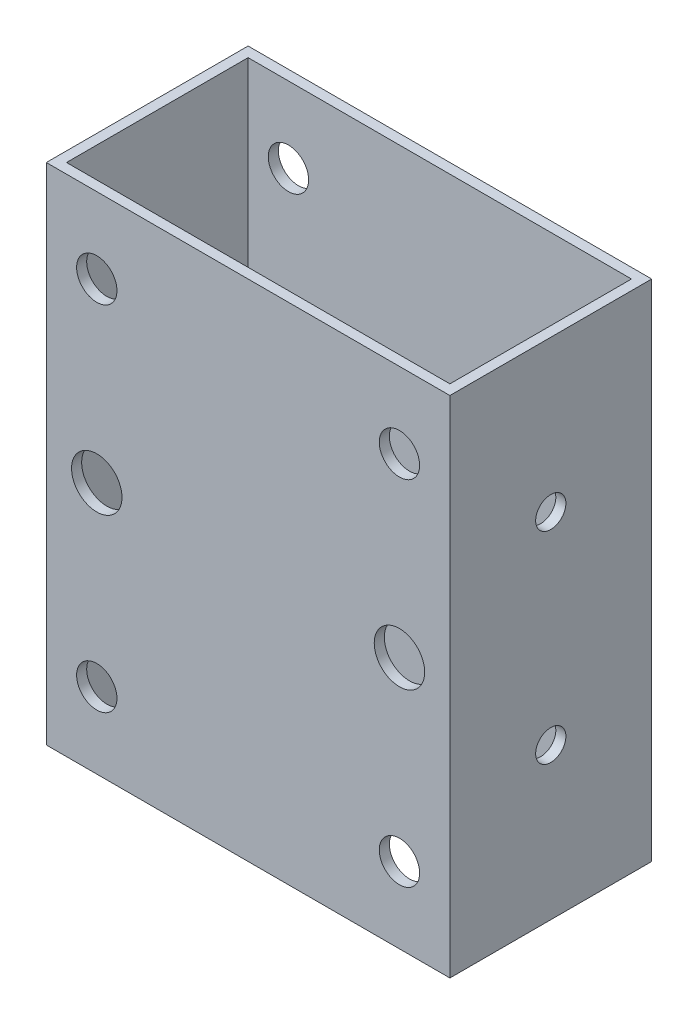
ISO-10303-21;
HEADER;
FILE_DESCRIPTION(('STEP AP214'),'2;1');
FILE_NAME('part.step','',(''),(''),'','','');
FILE_SCHEMA(('AUTOMOTIVE_DESIGN { 1 0 10303 214 1 1 1 1 }'));
ENDSEC;
DATA;
#1=APPLICATION_CONTEXT('core data for automotive mechanical design processes');
#2=APPLICATION_PROTOCOL_DEFINITION('international standard','automotive_design',2000,#1);
#3=PRODUCT_CONTEXT('',#1,'mechanical');
#4=PRODUCT('Part','Part','',(#3));
#5=PRODUCT_RELATED_PRODUCT_CATEGORY('part','',(#4));
#6=PRODUCT_DEFINITION_FORMATION('','',#4);
#7=PRODUCT_DEFINITION_CONTEXT('part definition',#1,'design');
#8=PRODUCT_DEFINITION('design','',#6,#7);
#9=PRODUCT_DEFINITION_SHAPE('','',#8);
#10=(LENGTH_UNIT() NAMED_UNIT(*) SI_UNIT(.MILLI.,.METRE.));
#11=(NAMED_UNIT(*) PLANE_ANGLE_UNIT() SI_UNIT($,.RADIAN.));
#12=(NAMED_UNIT(*) SI_UNIT($,.STERADIAN.) SOLID_ANGLE_UNIT());
#13=UNCERTAINTY_MEASURE_WITH_UNIT(LENGTH_MEASURE(1.E-05),#10,'distance_accuracy_value','');
#14=(GEOMETRIC_REPRESENTATION_CONTEXT(3) GLOBAL_UNCERTAINTY_ASSIGNED_CONTEXT((#13)) GLOBAL_UNIT_ASSIGNED_CONTEXT((#10,
#11,#12)) REPRESENTATION_CONTEXT('',''));
#15=CARTESIAN_POINT('',(0.,0.,0.));
#16=DIRECTION('',(0.,0.,1.));
#17=DIRECTION('',(1.,0.,0.));
#18=AXIS2_PLACEMENT_3D('',#15,#16,#17);
#19=CARTESIAN_POINT('',(0.,100.,0.));
#20=DIRECTION('',(0.,-1.,0.));
#21=DIRECTION('',(0.,0.,-1.));
#22=AXIS2_PLACEMENT_3D('',#19,#20,#21);
#23=PLANE('',#22);
#24=DIRECTION('',(0.,0.,1.));
#25=VECTOR('',#24,1.);
#26=CARTESIAN_POINT('',(0.,100.,0.));
#27=LINE('',#26,#25);
#28=CARTESIAN_POINT('',(0.,100.,-40.));
#29=VERTEX_POINT('',#28);
#30=CARTESIAN_POINT('',(0.,100.,0.));
#31=VERTEX_POINT('',#30);
#32=EDGE_CURVE('E138',#29,#31,#27,.T.);
#33=ORIENTED_EDGE('',*,*,#32,.T.);
#34=DIRECTION('',(1.,0.,0.));
#35=VECTOR('',#34,1.);
#36=CARTESIAN_POINT('',(0.,100.,0.));
#37=LINE('',#36,#35);
#38=CARTESIAN_POINT('',(80.,100.,0.));
#39=VERTEX_POINT('',#38);
#40=EDGE_CURVE('E141',#31,#39,#37,.T.);
#41=ORIENTED_EDGE('',*,*,#40,.T.);
#42=DIRECTION('',(0.,0.,-1.));
#43=VECTOR('',#42,1.);
#44=CARTESIAN_POINT('',(80.,100.,0.));
#45=LINE('',#44,#43);
#46=CARTESIAN_POINT('',(80.,100.,-40.));
#47=VERTEX_POINT('',#46);
#48=EDGE_CURVE('E144',#39,#47,#45,.T.);
#49=ORIENTED_EDGE('',*,*,#48,.T.);
#50=DIRECTION('',(-1.,0.,0.));
#51=VECTOR('',#50,1.);
#52=CARTESIAN_POINT('',(0.,100.,-40.));
#53=LINE('',#52,#51);
#54=EDGE_CURVE('E146',#47,#29,#53,.T.);
#55=ORIENTED_EDGE('',*,*,#54,.T.);
#56=EDGE_LOOP('',(#33,#41,#49,#55));
#57=FACE_BOUND('',#56,.T.);
#58=DIRECTION('',(1.,0.,0.));
#59=VECTOR('',#58,1.);
#60=CARTESIAN_POINT('',(2.,100.,-2.));
#61=LINE('',#60,#59);
#62=CARTESIAN_POINT('',(2.,100.,-2.));
#63=VERTEX_POINT('',#62);
#64=CARTESIAN_POINT('',(78.,100.,-2.));
#65=VERTEX_POINT('',#64);
#66=EDGE_CURVE('E100',#63,#65,#61,.T.);
#67=ORIENTED_EDGE('',*,*,#66,.F.);
#68=DIRECTION('',(0.,0.,1.));
#69=VECTOR('',#68,1.);
#70=CARTESIAN_POINT('',(2.,100.,-2.));
#71=LINE('',#70,#69);
#72=CARTESIAN_POINT('',(2.,100.,-38.));
#73=VERTEX_POINT('',#72);
#74=EDGE_CURVE('E122',#73,#63,#71,.T.);
#75=ORIENTED_EDGE('',*,*,#74,.F.);
#76=DIRECTION('',(-1.,0.,0.));
#77=VECTOR('',#76,1.);
#78=CARTESIAN_POINT('',(2.,100.,-38.));
#79=LINE('',#78,#77);
#80=CARTESIAN_POINT('',(78.,100.,-38.));
#81=VERTEX_POINT('',#80);
#82=EDGE_CURVE('E120',#81,#73,#79,.T.);
#83=ORIENTED_EDGE('',*,*,#82,.F.);
#84=DIRECTION('',(0.,0.,-1.));
#85=VECTOR('',#84,1.);
#86=CARTESIAN_POINT('',(78.,100.,-2.));
#87=LINE('',#86,#85);
#88=EDGE_CURVE('E108',#65,#81,#87,.T.);
#89=ORIENTED_EDGE('',*,*,#88,.F.);
#90=EDGE_LOOP('',(#67,#75,#83,#89));
#91=FACE_BOUND('',#90,.T.);
#92=ADVANCED_FACE('F33',(#57,#91),#23,.F.);
#93=CARTESIAN_POINT('',(0.,0.,0.));
#94=DIRECTION('',(0.,-1.,0.));
#95=DIRECTION('',(0.,0.,-1.));
#96=AXIS2_PLACEMENT_3D('',#93,#94,#95);
#97=PLANE('',#96);
#98=DIRECTION('',(0.,0.,1.));
#99=VECTOR('',#98,1.);
#100=CARTESIAN_POINT('',(0.,0.,0.));
#101=LINE('',#100,#99);
#102=CARTESIAN_POINT('',(0.,0.,-40.));
#103=VERTEX_POINT('',#102);
#104=CARTESIAN_POINT('',(0.,0.,0.));
#105=VERTEX_POINT('',#104);
#106=EDGE_CURVE('E116',#103,#105,#101,.T.);
#107=ORIENTED_EDGE('',*,*,#106,.F.);
#108=DIRECTION('',(-1.,0.,0.));
#109=VECTOR('',#108,1.);
#110=CARTESIAN_POINT('',(0.,0.,-40.));
#111=LINE('',#110,#109);
#112=CARTESIAN_POINT('',(80.,0.,-40.));
#113=VERTEX_POINT('',#112);
#114=EDGE_CURVE('E142',#113,#103,#111,.T.);
#115=ORIENTED_EDGE('',*,*,#114,.F.);
#116=DIRECTION('',(0.,0.,-1.));
#117=VECTOR('',#116,1.);
#118=CARTESIAN_POINT('',(80.,0.,0.));
#119=LINE('',#118,#117);
#120=CARTESIAN_POINT('',(80.,0.,0.));
#121=VERTEX_POINT('',#120);
#122=EDGE_CURVE('E153',#121,#113,#119,.T.);
#123=ORIENTED_EDGE('',*,*,#122,.F.);
#124=DIRECTION('',(1.,0.,0.));
#125=VECTOR('',#124,1.);
#126=CARTESIAN_POINT('',(0.,0.,0.));
#127=LINE('',#126,#125);
#128=EDGE_CURVE('E151',#105,#121,#127,.T.);
#129=ORIENTED_EDGE('',*,*,#128,.F.);
#130=EDGE_LOOP('',(#107,#115,#123,#129));
#131=FACE_BOUND('',#130,.T.);
#132=DIRECTION('',(0.,0.,1.));
#133=VECTOR('',#132,1.);
#134=CARTESIAN_POINT('',(2.,0.,-2.));
#135=LINE('',#134,#133);
#136=CARTESIAN_POINT('',(2.,0.,-38.));
#137=VERTEX_POINT('',#136);
#138=CARTESIAN_POINT('',(2.,0.,-2.));
#139=VERTEX_POINT('',#138);
#140=EDGE_CURVE('E109',#137,#139,#135,.T.);
#141=ORIENTED_EDGE('',*,*,#140,.T.);
#142=DIRECTION('',(1.,0.,0.));
#143=VECTOR('',#142,1.);
#144=CARTESIAN_POINT('',(2.,0.,-2.));
#145=LINE('',#144,#143);
#146=CARTESIAN_POINT('',(78.,0.,-2.));
#147=VERTEX_POINT('',#146);
#148=EDGE_CURVE('E58',#139,#147,#145,.T.);
#149=ORIENTED_EDGE('',*,*,#148,.T.);
#150=DIRECTION('',(0.,0.,-1.));
#151=VECTOR('',#150,1.);
#152=CARTESIAN_POINT('',(78.,0.,-2.));
#153=LINE('',#152,#151);
#154=CARTESIAN_POINT('',(78.,0.,-38.));
#155=VERTEX_POINT('',#154);
#156=EDGE_CURVE('E115',#147,#155,#153,.T.);
#157=ORIENTED_EDGE('',*,*,#156,.T.);
#158=DIRECTION('',(-1.,0.,0.));
#159=VECTOR('',#158,1.);
#160=CARTESIAN_POINT('',(2.,0.,-38.));
#161=LINE('',#160,#159);
#162=EDGE_CURVE('E130',#155,#137,#161,.T.);
#163=ORIENTED_EDGE('',*,*,#162,.T.);
#164=EDGE_LOOP('',(#141,#149,#157,#163));
#165=FACE_BOUND('',#164,.T.);
#166=ADVANCED_FACE('F272',(#131,#165),#97,.T.);
#167=CARTESIAN_POINT('',(0.,100.,0.));
#168=DIRECTION('',(1.,0.,0.));
#169=DIRECTION('',(0.,0.,-1.));
#170=AXIS2_PLACEMENT_3D('',#167,#168,#169);
#171=PLANE('',#170);
#172=CARTESIAN_POINT('',(0.,70.,-20.));
#173=DIRECTION('',(-1.,0.,0.));
#174=DIRECTION('',(0.,0.,-1.));
#175=AXIS2_PLACEMENT_3D('',#172,#173,#174);
#176=CIRCLE('',#175,3.);
#177=CARTESIAN_POINT('',(0.,70.,-23.));
#178=VERTEX_POINT('',#177);
#179=EDGE_CURVE('E375',#178,#178,#176,.T.);
#180=ORIENTED_EDGE('',*,*,#179,.F.);
#181=EDGE_LOOP('',(#180));
#182=FACE_BOUND('',#181,.T.);
#183=CARTESIAN_POINT('',(0.,30.,-20.));
#184=DIRECTION('',(-1.,0.,0.));
#185=DIRECTION('',(0.,0.,1.));
#186=AXIS2_PLACEMENT_3D('',#183,#184,#185);
#187=CIRCLE('',#186,3.);
#188=CARTESIAN_POINT('',(0.,30.,-17.));
#189=VERTEX_POINT('',#188);
#190=EDGE_CURVE('E197',#189,#189,#187,.T.);
#191=ORIENTED_EDGE('',*,*,#190,.F.);
#192=EDGE_LOOP('',(#191));
#193=FACE_BOUND('',#192,.T.);
#194=ORIENTED_EDGE('',*,*,#106,.T.);
#195=DIRECTION('',(0.,-1.,0.));
#196=VECTOR('',#195,1.);
#197=CARTESIAN_POINT('',(0.,100.,0.));
#198=LINE('',#197,#196);
#199=EDGE_CURVE('E11',#31,#105,#198,.T.);
#200=ORIENTED_EDGE('',*,*,#199,.F.);
#201=ORIENTED_EDGE('',*,*,#32,.F.);
#202=DIRECTION('',(0.,-1.,0.));
#203=VECTOR('',#202,1.);
#204=CARTESIAN_POINT('',(0.,100.,-40.));
#205=LINE('',#204,#203);
#206=EDGE_CURVE('E148',#29,#103,#205,.T.);
#207=ORIENTED_EDGE('',*,*,#206,.T.);
#208=EDGE_LOOP('',(#194,#200,#201,#207));
#209=FACE_BOUND('',#208,.T.);
#210=ADVANCED_FACE('F35',(#182,#193,#209),#171,.F.);
#211=CARTESIAN_POINT('',(0.,100.,0.));
#212=DIRECTION('',(0.,0.,-1.));
#213=DIRECTION('',(-1.,0.,0.));
#214=AXIS2_PLACEMENT_3D('',#211,#212,#213);
#215=PLANE('',#214);
#216=CARTESIAN_POINT('',(10.,15.,0.));
#217=DIRECTION('',(0.,0.,1.));
#218=DIRECTION('',(1.,0.,0.));
#219=AXIS2_PLACEMENT_3D('',#216,#217,#218);
#220=CIRCLE('',#219,4.);
#221=CARTESIAN_POINT('',(14.,15.,0.));
#222=VERTEX_POINT('',#221);
#223=EDGE_CURVE('E206',#222,#222,#220,.T.);
#224=ORIENTED_EDGE('',*,*,#223,.F.);
#225=EDGE_LOOP('',(#224));
#226=FACE_BOUND('',#225,.T.);
#227=CARTESIAN_POINT('',(70.,15.,0.));
#228=DIRECTION('',(0.,0.,1.));
#229=DIRECTION('',(1.,0.,0.));
#230=AXIS2_PLACEMENT_3D('',#227,#228,#229);
#231=CIRCLE('',#230,4.00000000000001);
#232=CARTESIAN_POINT('',(74.,15.,0.));
#233=VERTEX_POINT('',#232);
#234=EDGE_CURVE('E212',#233,#233,#231,.T.);
#235=ORIENTED_EDGE('',*,*,#234,.F.);
#236=EDGE_LOOP('',(#235));
#237=FACE_BOUND('',#236,.T.);
#238=CARTESIAN_POINT('',(70.,50.,0.));
#239=DIRECTION('',(0.,0.,1.));
#240=DIRECTION('',(-1.,0.,0.));
#241=AXIS2_PLACEMENT_3D('',#238,#239,#240);
#242=CIRCLE('',#241,4.99999999999999);
#243=CARTESIAN_POINT('',(65.,50.,0.));
#244=VERTEX_POINT('',#243);
#245=EDGE_CURVE('E194',#244,#244,#242,.T.);
#246=ORIENTED_EDGE('',*,*,#245,.F.);
#247=EDGE_LOOP('',(#246));
#248=FACE_BOUND('',#247,.T.);
#249=CARTESIAN_POINT('',(10.,85.,0.));
#250=DIRECTION('',(0.,0.,1.));
#251=DIRECTION('',(1.,0.,0.));
#252=AXIS2_PLACEMENT_3D('',#249,#250,#251);
#253=CIRCLE('',#252,4.);
#254=CARTESIAN_POINT('',(14.,85.,0.));
#255=VERTEX_POINT('',#254);
#256=EDGE_CURVE('E218',#255,#255,#253,.T.);
#257=ORIENTED_EDGE('',*,*,#256,.F.);
#258=EDGE_LOOP('',(#257));
#259=FACE_BOUND('',#258,.T.);
#260=CARTESIAN_POINT('',(70.,85.,0.));
#261=DIRECTION('',(0.,0.,1.));
#262=DIRECTION('',(1.,0.,0.));
#263=AXIS2_PLACEMENT_3D('',#260,#261,#262);
#264=CIRCLE('',#263,4.00000000000001);
#265=CARTESIAN_POINT('',(74.,85.,0.));
#266=VERTEX_POINT('',#265);
#267=EDGE_CURVE('E225',#266,#266,#264,.T.);
#268=ORIENTED_EDGE('',*,*,#267,.F.);
#269=EDGE_LOOP('',(#268));
#270=FACE_BOUND('',#269,.T.);
#271=CARTESIAN_POINT('',(10.,50.,0.));
#272=DIRECTION('',(0.,0.,1.));
#273=DIRECTION('',(1.,0.,0.));
#274=AXIS2_PLACEMENT_3D('',#271,#272,#273);
#275=CIRCLE('',#274,5.);
#276=CARTESIAN_POINT('',(15.,50.,0.));
#277=VERTEX_POINT('',#276);
#278=EDGE_CURVE('E244',#277,#277,#275,.T.);
#279=ORIENTED_EDGE('',*,*,#278,.F.);
#280=EDGE_LOOP('',(#279));
#281=FACE_BOUND('',#280,.T.);
#282=ORIENTED_EDGE('',*,*,#128,.T.);
#283=DIRECTION('',(0.,-1.,0.));
#284=VECTOR('',#283,1.);
#285=CARTESIAN_POINT('',(80.,100.,0.));
#286=LINE('',#285,#284);
#287=EDGE_CURVE('E42',#39,#121,#286,.T.);
#288=ORIENTED_EDGE('',*,*,#287,.F.);
#289=ORIENTED_EDGE('',*,*,#40,.F.);
#290=ORIENTED_EDGE('',*,*,#199,.T.);
#291=EDGE_LOOP('',(#282,#288,#289,#290));
#292=FACE_BOUND('',#291,.T.);
#293=ADVANCED_FACE('F281',(#226,#237,#248,#259,#270,#281,#292),#215,.F.);
#294=CARTESIAN_POINT('',(80.,100.,0.));
#295=DIRECTION('',(-1.,0.,0.));
#296=DIRECTION('',(0.,0.,1.));
#297=AXIS2_PLACEMENT_3D('',#294,#295,#296);
#298=PLANE('',#297);
#299=CARTESIAN_POINT('',(80.,70.,-20.));
#300=DIRECTION('',(-1.,0.,0.));
#301=DIRECTION('',(0.,0.,1.));
#302=AXIS2_PLACEMENT_3D('',#299,#300,#301);
#303=CIRCLE('',#302,3.);
#304=CARTESIAN_POINT('',(80.,70.,-17.));
#305=VERTEX_POINT('',#304);
#306=EDGE_CURVE('E376',#305,#305,#303,.F.);
#307=ORIENTED_EDGE('',*,*,#306,.F.);
#308=EDGE_LOOP('',(#307));
#309=FACE_BOUND('',#308,.T.);
#310=CARTESIAN_POINT('',(80.,30.,-20.));
#311=DIRECTION('',(-1.,0.,0.));
#312=DIRECTION('',(0.,0.,1.));
#313=AXIS2_PLACEMENT_3D('',#310,#311,#312);
#314=CIRCLE('',#313,3.);
#315=CARTESIAN_POINT('',(80.,30.,-17.));
#316=VERTEX_POINT('',#315);
#317=EDGE_CURVE('E190',#316,#316,#314,.F.);
#318=ORIENTED_EDGE('',*,*,#317,.F.);
#319=EDGE_LOOP('',(#318));
#320=FACE_BOUND('',#319,.T.);
#321=ORIENTED_EDGE('',*,*,#122,.T.);
#322=DIRECTION('',(0.,-1.,0.));
#323=VECTOR('',#322,1.);
#324=CARTESIAN_POINT('',(80.,100.,-40.));
#325=LINE('',#324,#323);
#326=EDGE_CURVE('E158',#47,#113,#325,.T.);
#327=ORIENTED_EDGE('',*,*,#326,.F.);
#328=ORIENTED_EDGE('',*,*,#48,.F.);
#329=ORIENTED_EDGE('',*,*,#287,.T.);
#330=EDGE_LOOP('',(#321,#327,#328,#329));
#331=FACE_BOUND('',#330,.T.);
#332=ADVANCED_FACE('F265',(#309,#320,#331),#298,.F.);
#333=CARTESIAN_POINT('',(0.,100.,-40.));
#334=DIRECTION('',(0.,0.,1.));
#335=DIRECTION('',(1.,0.,0.));
#336=AXIS2_PLACEMENT_3D('',#333,#334,#335);
#337=PLANE('',#336);
#338=CARTESIAN_POINT('',(10.,15.,-40.));
#339=DIRECTION('',(0.,0.,1.));
#340=DIRECTION('',(1.,0.,0.));
#341=AXIS2_PLACEMENT_3D('',#338,#339,#340);
#342=CIRCLE('',#341,4.);
#343=CARTESIAN_POINT('',(14.,15.,-40.));
#344=VERTEX_POINT('',#343);
#345=EDGE_CURVE('E171',#344,#344,#342,.F.);
#346=ORIENTED_EDGE('',*,*,#345,.F.);
#347=EDGE_LOOP('',(#346));
#348=FACE_BOUND('',#347,.T.);
#349=CARTESIAN_POINT('',(70.,15.,-40.));
#350=DIRECTION('',(0.,0.,1.));
#351=DIRECTION('',(1.,0.,0.));
#352=AXIS2_PLACEMENT_3D('',#349,#350,#351);
#353=CIRCLE('',#352,4.00000000000001);
#354=CARTESIAN_POINT('',(74.,15.,-40.));
#355=VERTEX_POINT('',#354);
#356=EDGE_CURVE('E209',#355,#355,#353,.F.);
#357=ORIENTED_EDGE('',*,*,#356,.F.);
#358=EDGE_LOOP('',(#357));
#359=FACE_BOUND('',#358,.T.);
#360=CARTESIAN_POINT('',(70.,50.,-40.));
#361=DIRECTION('',(0.,0.,1.));
#362=DIRECTION('',(1.,0.,0.));
#363=AXIS2_PLACEMENT_3D('',#360,#361,#362);
#364=CIRCLE('',#363,4.99999999999999);
#365=CARTESIAN_POINT('',(75.,50.,-40.));
#366=VERTEX_POINT('',#365);
#367=EDGE_CURVE('E222',#366,#366,#364,.F.);
#368=ORIENTED_EDGE('',*,*,#367,.F.);
#369=EDGE_LOOP('',(#368));
#370=FACE_BOUND('',#369,.T.);
#371=CARTESIAN_POINT('',(10.,85.,-40.));
#372=DIRECTION('',(0.,0.,1.));
#373=DIRECTION('',(1.,0.,0.));
#374=AXIS2_PLACEMENT_3D('',#371,#372,#373);
#375=CIRCLE('',#374,4.);
#376=CARTESIAN_POINT('',(14.,85.,-40.));
#377=VERTEX_POINT('',#376);
#378=EDGE_CURVE('E221',#377,#377,#375,.F.);
#379=ORIENTED_EDGE('',*,*,#378,.F.);
#380=EDGE_LOOP('',(#379));
#381=FACE_BOUND('',#380,.T.);
#382=CARTESIAN_POINT('',(70.,85.,-40.));
#383=DIRECTION('',(0.,0.,1.));
#384=DIRECTION('',(1.,0.,0.));
#385=AXIS2_PLACEMENT_3D('',#382,#383,#384);
#386=CIRCLE('',#385,4.00000000000001);
#387=CARTESIAN_POINT('',(74.,85.,-40.));
#388=VERTEX_POINT('',#387);
#389=EDGE_CURVE('E215',#388,#388,#386,.F.);
#390=ORIENTED_EDGE('',*,*,#389,.F.);
#391=EDGE_LOOP('',(#390));
#392=FACE_BOUND('',#391,.T.);
#393=CARTESIAN_POINT('',(10.,50.,-40.));
#394=DIRECTION('',(0.,0.,1.));
#395=DIRECTION('',(1.,0.,0.));
#396=AXIS2_PLACEMENT_3D('',#393,#394,#395);
#397=CIRCLE('',#396,5.);
#398=CARTESIAN_POINT('',(15.,50.,-40.));
#399=VERTEX_POINT('',#398);
#400=EDGE_CURVE('E166',#399,#399,#397,.F.);
#401=ORIENTED_EDGE('',*,*,#400,.F.);
#402=EDGE_LOOP('',(#401));
#403=FACE_BOUND('',#402,.T.);
#404=ORIENTED_EDGE('',*,*,#114,.T.);
#405=ORIENTED_EDGE('',*,*,#206,.F.);
#406=ORIENTED_EDGE('',*,*,#54,.F.);
#407=ORIENTED_EDGE('',*,*,#326,.T.);
#408=EDGE_LOOP('',(#404,#405,#406,#407));
#409=FACE_BOUND('',#408,.T.);
#410=ADVANCED_FACE('F255',(#348,#359,#370,#381,#392,#403,#409),#337,.F.);
#411=CARTESIAN_POINT('',(2.,100.,-2.));
#412=DIRECTION('',(0.,0.,-1.));
#413=DIRECTION('',(-1.,0.,0.));
#414=AXIS2_PLACEMENT_3D('',#411,#412,#413);
#415=PLANE('',#414);
#416=CARTESIAN_POINT('',(10.,15.,-2.));
#417=DIRECTION('',(0.,0.,-1.));
#418=DIRECTION('',(-1.,0.,0.));
#419=AXIS2_PLACEMENT_3D('',#416,#417,#418);
#420=CIRCLE('',#419,4.);
#421=CARTESIAN_POINT('',(6.,15.,-2.));
#422=VERTEX_POINT('',#421);
#423=EDGE_CURVE('E186',#422,#422,#420,.T.);
#424=ORIENTED_EDGE('',*,*,#423,.F.);
#425=EDGE_LOOP('',(#424));
#426=FACE_BOUND('',#425,.T.);
#427=CARTESIAN_POINT('',(70.,15.,-2.));
#428=DIRECTION('',(0.,0.,-1.));
#429=DIRECTION('',(-1.,0.,0.));
#430=AXIS2_PLACEMENT_3D('',#427,#428,#429);
#431=CIRCLE('',#430,4.00000000000001);
#432=CARTESIAN_POINT('',(66.,15.,-2.));
#433=VERTEX_POINT('',#432);
#434=EDGE_CURVE('E183',#433,#433,#431,.T.);
#435=ORIENTED_EDGE('',*,*,#434,.F.);
#436=EDGE_LOOP('',(#435));
#437=FACE_BOUND('',#436,.T.);
#438=CARTESIAN_POINT('',(70.,50.,-2.));
#439=DIRECTION('',(0.,0.,-1.));
#440=DIRECTION('',(-1.,0.,0.));
#441=AXIS2_PLACEMENT_3D('',#438,#439,#440);
#442=CIRCLE('',#441,4.99999999999999);
#443=CARTESIAN_POINT('',(65.,50.,-2.));
#444=VERTEX_POINT('',#443);
#445=EDGE_CURVE('E179',#444,#444,#442,.T.);
#446=ORIENTED_EDGE('',*,*,#445,.F.);
#447=EDGE_LOOP('',(#446));
#448=FACE_BOUND('',#447,.T.);
#449=CARTESIAN_POINT('',(10.,85.,-2.));
#450=DIRECTION('',(0.,0.,-1.));
#451=DIRECTION('',(-1.,0.,0.));
#452=AXIS2_PLACEMENT_3D('',#449,#450,#451);
#453=CIRCLE('',#452,4.);
#454=CARTESIAN_POINT('',(6.,85.,-2.));
#455=VERTEX_POINT('',#454);
#456=EDGE_CURVE('E175',#455,#455,#453,.T.);
#457=ORIENTED_EDGE('',*,*,#456,.F.);
#458=EDGE_LOOP('',(#457));
#459=FACE_BOUND('',#458,.T.);
#460=CARTESIAN_POINT('',(70.,85.,-2.));
#461=DIRECTION('',(0.,0.,-1.));
#462=DIRECTION('',(-1.,0.,0.));
#463=AXIS2_PLACEMENT_3D('',#460,#461,#462);
#464=CIRCLE('',#463,4.00000000000001);
#465=CARTESIAN_POINT('',(66.,85.,-2.));
#466=VERTEX_POINT('',#465);
#467=EDGE_CURVE('E170',#466,#466,#464,.T.);
#468=ORIENTED_EDGE('',*,*,#467,.F.);
#469=EDGE_LOOP('',(#468));
#470=FACE_BOUND('',#469,.T.);
#471=CARTESIAN_POINT('',(10.,50.,-2.));
#472=DIRECTION('',(0.,0.,-1.));
#473=DIRECTION('',(-1.,0.,0.));
#474=AXIS2_PLACEMENT_3D('',#471,#472,#473);
#475=CIRCLE('',#474,5.);
#476=CARTESIAN_POINT('',(5.,50.,-2.));
#477=VERTEX_POINT('',#476);
#478=EDGE_CURVE('E128',#477,#477,#475,.T.);
#479=ORIENTED_EDGE('',*,*,#478,.F.);
#480=EDGE_LOOP('',(#479));
#481=FACE_BOUND('',#480,.T.);
#482=ORIENTED_EDGE('',*,*,#148,.F.);
#483=DIRECTION('',(0.,-1.,0.));
#484=VECTOR('',#483,1.);
#485=CARTESIAN_POINT('',(2.,100.,-2.));
#486=LINE('',#485,#484);
#487=EDGE_CURVE('E104',#63,#139,#486,.T.);
#488=ORIENTED_EDGE('',*,*,#487,.F.);
#489=ORIENTED_EDGE('',*,*,#66,.T.);
#490=DIRECTION('',(0.,-1.,0.));
#491=VECTOR('',#490,1.);
#492=CARTESIAN_POINT('',(78.,100.,-2.));
#493=LINE('',#492,#491);
#494=EDGE_CURVE('E103',#65,#147,#493,.T.);
#495=ORIENTED_EDGE('',*,*,#494,.T.);
#496=EDGE_LOOP('',(#482,#488,#489,#495));
#497=FACE_BOUND('',#496,.T.);
#498=ADVANCED_FACE('F102',(#426,#437,#448,#459,#470,#481,#497),#415,.T.);
#499=CARTESIAN_POINT('',(78.,100.,-2.));
#500=DIRECTION('',(-1.,0.,0.));
#501=DIRECTION('',(0.,0.,1.));
#502=AXIS2_PLACEMENT_3D('',#499,#500,#501);
#503=PLANE('',#502);
#504=CARTESIAN_POINT('',(78.,70.,-20.));
#505=DIRECTION('',(-1.,0.,0.));
#506=DIRECTION('',(0.,0.,1.));
#507=AXIS2_PLACEMENT_3D('',#504,#505,#506);
#508=CIRCLE('',#507,3.);
#509=CARTESIAN_POINT('',(78.,70.,-17.));
#510=VERTEX_POINT('',#509);
#511=EDGE_CURVE('E202',#510,#510,#508,.T.);
#512=ORIENTED_EDGE('',*,*,#511,.F.);
#513=EDGE_LOOP('',(#512));
#514=FACE_BOUND('',#513,.T.);
#515=CARTESIAN_POINT('',(78.,30.,-20.));
#516=DIRECTION('',(-1.,0.,0.));
#517=DIRECTION('',(0.,0.,1.));
#518=AXIS2_PLACEMENT_3D('',#515,#516,#517);
#519=CIRCLE('',#518,3.);
#520=CARTESIAN_POINT('',(78.,30.,-17.));
#521=VERTEX_POINT('',#520);
#522=EDGE_CURVE('E189',#521,#521,#519,.T.);
#523=ORIENTED_EDGE('',*,*,#522,.F.);
#524=EDGE_LOOP('',(#523));
#525=FACE_BOUND('',#524,.T.);
#526=ORIENTED_EDGE('',*,*,#156,.F.);
#527=ORIENTED_EDGE('',*,*,#494,.F.);
#528=ORIENTED_EDGE('',*,*,#88,.T.);
#529=DIRECTION('',(0.,-1.,0.));
#530=VECTOR('',#529,1.);
#531=CARTESIAN_POINT('',(78.,100.,-38.));
#532=LINE('',#531,#530);
#533=EDGE_CURVE('E117',#81,#155,#532,.T.);
#534=ORIENTED_EDGE('',*,*,#533,.T.);
#535=EDGE_LOOP('',(#526,#527,#528,#534));
#536=FACE_BOUND('',#535,.T.);
#537=ADVANCED_FACE('F112',(#514,#525,#536),#503,.T.);
#538=CARTESIAN_POINT('',(2.,100.,-38.));
#539=DIRECTION('',(0.,0.,1.));
#540=DIRECTION('',(1.,0.,0.));
#541=AXIS2_PLACEMENT_3D('',#538,#539,#540);
#542=PLANE('',#541);
#543=CARTESIAN_POINT('',(10.,15.,-38.));
#544=DIRECTION('',(0.,0.,1.));
#545=DIRECTION('',(1.,0.,0.));
#546=AXIS2_PLACEMENT_3D('',#543,#544,#545);
#547=CIRCLE('',#546,4.);
#548=CARTESIAN_POINT('',(14.,15.,-38.));
#549=VERTEX_POINT('',#548);
#550=EDGE_CURVE('E184',#549,#549,#547,.T.);
#551=ORIENTED_EDGE('',*,*,#550,.F.);
#552=EDGE_LOOP('',(#551));
#553=FACE_BOUND('',#552,.T.);
#554=CARTESIAN_POINT('',(70.,15.,-38.));
#555=DIRECTION('',(0.,0.,1.));
#556=DIRECTION('',(1.,0.,0.));
#557=AXIS2_PLACEMENT_3D('',#554,#555,#556);
#558=CIRCLE('',#557,4.00000000000001);
#559=CARTESIAN_POINT('',(74.,15.,-38.));
#560=VERTEX_POINT('',#559);
#561=EDGE_CURVE('E180',#560,#560,#558,.T.);
#562=ORIENTED_EDGE('',*,*,#561,.F.);
#563=EDGE_LOOP('',(#562));
#564=FACE_BOUND('',#563,.T.);
#565=CARTESIAN_POINT('',(70.,50.,-38.));
#566=DIRECTION('',(0.,0.,1.));
#567=DIRECTION('',(1.,0.,0.));
#568=AXIS2_PLACEMENT_3D('',#565,#566,#567);
#569=CIRCLE('',#568,4.99999999999999);
#570=CARTESIAN_POINT('',(75.,50.,-38.));
#571=VERTEX_POINT('',#570);
#572=EDGE_CURVE('E176',#571,#571,#569,.T.);
#573=ORIENTED_EDGE('',*,*,#572,.F.);
#574=EDGE_LOOP('',(#573));
#575=FACE_BOUND('',#574,.T.);
#576=CARTESIAN_POINT('',(10.,85.,-38.));
#577=DIRECTION('',(0.,0.,1.));
#578=DIRECTION('',(1.,0.,0.));
#579=AXIS2_PLACEMENT_3D('',#576,#577,#578);
#580=CIRCLE('',#579,4.);
#581=CARTESIAN_POINT('',(14.,85.,-38.));
#582=VERTEX_POINT('',#581);
#583=EDGE_CURVE('E172',#582,#582,#580,.T.);
#584=ORIENTED_EDGE('',*,*,#583,.F.);
#585=EDGE_LOOP('',(#584));
#586=FACE_BOUND('',#585,.T.);
#587=CARTESIAN_POINT('',(70.,85.,-38.));
#588=DIRECTION('',(0.,0.,1.));
#589=DIRECTION('',(1.,0.,0.));
#590=AXIS2_PLACEMENT_3D('',#587,#588,#589);
#591=CIRCLE('',#590,4.00000000000001);
#592=CARTESIAN_POINT('',(74.,85.,-38.));
#593=VERTEX_POINT('',#592);
#594=EDGE_CURVE('E167',#593,#593,#591,.T.);
#595=ORIENTED_EDGE('',*,*,#594,.F.);
#596=EDGE_LOOP('',(#595));
#597=FACE_BOUND('',#596,.T.);
#598=CARTESIAN_POINT('',(10.,50.,-38.));
#599=DIRECTION('',(0.,0.,1.));
#600=DIRECTION('',(1.,0.,0.));
#601=AXIS2_PLACEMENT_3D('',#598,#599,#600);
#602=CIRCLE('',#601,5.);
#603=CARTESIAN_POINT('',(15.,50.,-38.));
#604=VERTEX_POINT('',#603);
#605=EDGE_CURVE('E163',#604,#604,#602,.T.);
#606=ORIENTED_EDGE('',*,*,#605,.F.);
#607=EDGE_LOOP('',(#606));
#608=FACE_BOUND('',#607,.T.);
#609=ORIENTED_EDGE('',*,*,#162,.F.);
#610=ORIENTED_EDGE('',*,*,#533,.F.);
#611=ORIENTED_EDGE('',*,*,#82,.T.);
#612=DIRECTION('',(0.,-1.,0.));
#613=VECTOR('',#612,1.);
#614=CARTESIAN_POINT('',(2.,100.,-38.));
#615=LINE('',#614,#613);
#616=EDGE_CURVE('E50',#73,#137,#615,.T.);
#617=ORIENTED_EDGE('',*,*,#616,.T.);
#618=EDGE_LOOP('',(#609,#610,#611,#617));
#619=FACE_BOUND('',#618,.T.);
#620=ADVANCED_FACE('F262',(#553,#564,#575,#586,#597,#608,#619),#542,.T.);
#621=CARTESIAN_POINT('',(2.,100.,-2.));
#622=DIRECTION('',(1.,0.,0.));
#623=DIRECTION('',(0.,0.,-1.));
#624=AXIS2_PLACEMENT_3D('',#621,#622,#623);
#625=PLANE('',#624);
#626=CARTESIAN_POINT('',(2.,70.,-20.));
#627=DIRECTION('',(1.,0.,0.));
#628=DIRECTION('',(0.,0.,-1.));
#629=AXIS2_PLACEMENT_3D('',#626,#627,#628);
#630=CIRCLE('',#629,3.);
#631=CARTESIAN_POINT('',(2.,70.,-23.));
#632=VERTEX_POINT('',#631);
#633=EDGE_CURVE('E37',#632,#632,#630,.T.);
#634=ORIENTED_EDGE('',*,*,#633,.F.);
#635=EDGE_LOOP('',(#634));
#636=FACE_BOUND('',#635,.T.);
#637=CARTESIAN_POINT('',(2.,30.,-20.));
#638=DIRECTION('',(1.,0.,0.));
#639=DIRECTION('',(0.,0.,-1.));
#640=AXIS2_PLACEMENT_3D('',#637,#638,#639);
#641=CIRCLE('',#640,3.);
#642=CARTESIAN_POINT('',(2.,30.,-23.));
#643=VERTEX_POINT('',#642);
#644=EDGE_CURVE('E187',#643,#643,#641,.T.);
#645=ORIENTED_EDGE('',*,*,#644,.F.);
#646=EDGE_LOOP('',(#645));
#647=FACE_BOUND('',#646,.T.);
#648=ORIENTED_EDGE('',*,*,#140,.F.);
#649=ORIENTED_EDGE('',*,*,#616,.F.);
#650=ORIENTED_EDGE('',*,*,#74,.T.);
#651=ORIENTED_EDGE('',*,*,#487,.T.);
#652=EDGE_LOOP('',(#648,#649,#650,#651));
#653=FACE_BOUND('',#652,.T.);
#654=ADVANCED_FACE('F316',(#636,#647,#653),#625,.T.);
#655=CARTESIAN_POINT('',(10.,50.,-54.1421356237309));
#656=DIRECTION('',(0.,0.,1.));
#657=DIRECTION('',(1.,0.,0.));
#658=AXIS2_PLACEMENT_3D('',#655,#656,#657);
#659=CYLINDRICAL_SURFACE('',#658,5.);
#660=ORIENTED_EDGE('',*,*,#605,.T.);
#661=EDGE_LOOP('',(#660));
#662=FACE_BOUND('',#661,.T.);
#663=ORIENTED_EDGE('',*,*,#400,.T.);
#664=EDGE_LOOP('',(#663));
#665=FACE_BOUND('',#664,.T.);
#666=ADVANCED_FACE('F318',(#662,#665),#659,.F.);
#667=ORIENTED_EDGE('',*,*,#478,.T.);
#668=EDGE_LOOP('',(#667));
#669=FACE_BOUND('',#668,.T.);
#670=ORIENTED_EDGE('',*,*,#278,.T.);
#671=EDGE_LOOP('',(#670));
#672=FACE_BOUND('',#671,.T.);
#673=ADVANCED_FACE('F251',(#669,#672),#659,.F.);
#674=CARTESIAN_POINT('',(70.,85.,-54.1421356237309));
#675=DIRECTION('',(0.,0.,1.));
#676=DIRECTION('',(1.,0.,0.));
#677=AXIS2_PLACEMENT_3D('',#674,#675,#676);
#678=CYLINDRICAL_SURFACE('',#677,4.00000000000001);
#679=ORIENTED_EDGE('',*,*,#594,.T.);
#680=EDGE_LOOP('',(#679));
#681=FACE_BOUND('',#680,.T.);
#682=ORIENTED_EDGE('',*,*,#389,.T.);
#683=EDGE_LOOP('',(#682));
#684=FACE_BOUND('',#683,.T.);
#685=ADVANCED_FACE('F332',(#681,#684),#678,.F.);
#686=CARTESIAN_POINT('',(10.,85.,-54.1421356237309));
#687=DIRECTION('',(0.,0.,1.));
#688=DIRECTION('',(1.,0.,0.));
#689=AXIS2_PLACEMENT_3D('',#686,#687,#688);
#690=CYLINDRICAL_SURFACE('',#689,4.);
#691=ORIENTED_EDGE('',*,*,#583,.T.);
#692=EDGE_LOOP('',(#691));
#693=FACE_BOUND('',#692,.T.);
#694=ORIENTED_EDGE('',*,*,#378,.T.);
#695=EDGE_LOOP('',(#694));
#696=FACE_BOUND('',#695,.T.);
#697=ADVANCED_FACE('F335',(#693,#696),#690,.F.);
#698=CARTESIAN_POINT('',(70.,50.,-54.1421356237309));
#699=DIRECTION('',(0.,0.,1.));
#700=DIRECTION('',(1.,0.,0.));
#701=AXIS2_PLACEMENT_3D('',#698,#699,#700);
#702=CYLINDRICAL_SURFACE('',#701,4.99999999999999);
#703=ORIENTED_EDGE('',*,*,#572,.T.);
#704=EDGE_LOOP('',(#703));
#705=FACE_BOUND('',#704,.T.);
#706=ORIENTED_EDGE('',*,*,#367,.T.);
#707=EDGE_LOOP('',(#706));
#708=FACE_BOUND('',#707,.T.);
#709=ADVANCED_FACE('F338',(#705,#708),#702,.F.);
#710=CARTESIAN_POINT('',(70.,15.,-54.1421356237309));
#711=DIRECTION('',(0.,0.,1.));
#712=DIRECTION('',(1.,0.,0.));
#713=AXIS2_PLACEMENT_3D('',#710,#711,#712);
#714=CYLINDRICAL_SURFACE('',#713,4.00000000000001);
#715=ORIENTED_EDGE('',*,*,#561,.T.);
#716=EDGE_LOOP('',(#715));
#717=FACE_BOUND('',#716,.T.);
#718=ORIENTED_EDGE('',*,*,#356,.T.);
#719=EDGE_LOOP('',(#718));
#720=FACE_BOUND('',#719,.T.);
#721=ADVANCED_FACE('F341',(#717,#720),#714,.F.);
#722=CARTESIAN_POINT('',(10.,15.,-54.1421356237309));
#723=DIRECTION('',(0.,0.,1.));
#724=DIRECTION('',(1.,0.,0.));
#725=AXIS2_PLACEMENT_3D('',#722,#723,#724);
#726=CYLINDRICAL_SURFACE('',#725,4.);
#727=ORIENTED_EDGE('',*,*,#550,.T.);
#728=EDGE_LOOP('',(#727));
#729=FACE_BOUND('',#728,.T.);
#730=ORIENTED_EDGE('',*,*,#345,.T.);
#731=EDGE_LOOP('',(#730));
#732=FACE_BOUND('',#731,.T.);
#733=ADVANCED_FACE('F350',(#729,#732),#726,.F.);
#734=ORIENTED_EDGE('',*,*,#467,.T.);
#735=EDGE_LOOP('',(#734));
#736=FACE_BOUND('',#735,.T.);
#737=ORIENTED_EDGE('',*,*,#267,.T.);
#738=EDGE_LOOP('',(#737));
#739=FACE_BOUND('',#738,.T.);
#740=ADVANCED_FACE('F337',(#736,#739),#678,.F.);
#741=ORIENTED_EDGE('',*,*,#456,.T.);
#742=EDGE_LOOP('',(#741));
#743=FACE_BOUND('',#742,.T.);
#744=ORIENTED_EDGE('',*,*,#256,.T.);
#745=EDGE_LOOP('',(#744));
#746=FACE_BOUND('',#745,.T.);
#747=ADVANCED_FACE('F347',(#743,#746),#690,.F.);
#748=ORIENTED_EDGE('',*,*,#445,.T.);
#749=EDGE_LOOP('',(#748));
#750=FACE_BOUND('',#749,.T.);
#751=ORIENTED_EDGE('',*,*,#245,.T.);
#752=EDGE_LOOP('',(#751));
#753=FACE_BOUND('',#752,.T.);
#754=ADVANCED_FACE('F343',(#750,#753),#702,.F.);
#755=ORIENTED_EDGE('',*,*,#434,.T.);
#756=EDGE_LOOP('',(#755));
#757=FACE_BOUND('',#756,.T.);
#758=ORIENTED_EDGE('',*,*,#234,.T.);
#759=EDGE_LOOP('',(#758));
#760=FACE_BOUND('',#759,.T.);
#761=ADVANCED_FACE('F352',(#757,#760),#714,.F.);
#762=ORIENTED_EDGE('',*,*,#423,.T.);
#763=EDGE_LOOP('',(#762));
#764=FACE_BOUND('',#763,.T.);
#765=ORIENTED_EDGE('',*,*,#223,.T.);
#766=EDGE_LOOP('',(#765));
#767=FACE_BOUND('',#766,.T.);
#768=ADVANCED_FACE('F356',(#764,#767),#726,.F.);
#769=CARTESIAN_POINT('',(88.4852813742386,30.,-20.));
#770=DIRECTION('',(-1.,0.,0.));
#771=DIRECTION('',(0.,0.,1.));
#772=AXIS2_PLACEMENT_3D('',#769,#770,#771);
#773=CYLINDRICAL_SURFACE('',#772,3.);
#774=ORIENTED_EDGE('',*,*,#644,.T.);
#775=EDGE_LOOP('',(#774));
#776=FACE_BOUND('',#775,.T.);
#777=ORIENTED_EDGE('',*,*,#190,.T.);
#778=EDGE_LOOP('',(#777));
#779=FACE_BOUND('',#778,.T.);
#780=ADVANCED_FACE('F357',(#776,#779),#773,.F.);
#781=ORIENTED_EDGE('',*,*,#522,.T.);
#782=EDGE_LOOP('',(#781));
#783=FACE_BOUND('',#782,.T.);
#784=ORIENTED_EDGE('',*,*,#317,.T.);
#785=EDGE_LOOP('',(#784));
#786=FACE_BOUND('',#785,.T.);
#787=ADVANCED_FACE('F360',(#783,#786),#773,.F.);
#788=CARTESIAN_POINT('',(88.4852813742386,70.,-20.));
#789=DIRECTION('',(-1.,0.,0.));
#790=DIRECTION('',(0.,0.,1.));
#791=AXIS2_PLACEMENT_3D('',#788,#789,#790);
#792=CYLINDRICAL_SURFACE('',#791,3.);
#793=ORIENTED_EDGE('',*,*,#633,.T.);
#794=EDGE_LOOP('',(#793));
#795=FACE_BOUND('',#794,.T.);
#796=ORIENTED_EDGE('',*,*,#179,.T.);
#797=EDGE_LOOP('',(#796));
#798=FACE_BOUND('',#797,.T.);
#799=ADVANCED_FACE('F361',(#795,#798),#792,.F.);
#800=ORIENTED_EDGE('',*,*,#511,.T.);
#801=EDGE_LOOP('',(#800));
#802=FACE_BOUND('',#801,.T.);
#803=ORIENTED_EDGE('',*,*,#306,.T.);
#804=EDGE_LOOP('',(#803));
#805=FACE_BOUND('',#804,.T.);
#806=ADVANCED_FACE('F363',(#802,#805),#792,.F.);
#807=CLOSED_SHELL('',(#92,#166,#210,#293,#332,#410,#498,#537,#620,#654,#666,#673,#685,#697,#709,
#721,#733,#740,#747,#754,#761,#768,#780,#787,#799,#806));
#808=MANIFOLD_SOLID_BREP('B2',#807);
#809=ADVANCED_BREP_SHAPE_REPRESENTATION('',(#18,#808),#14);
#810=SHAPE_DEFINITION_REPRESENTATION(#9,#809);
ENDSEC;
END-ISO-10303-21;
